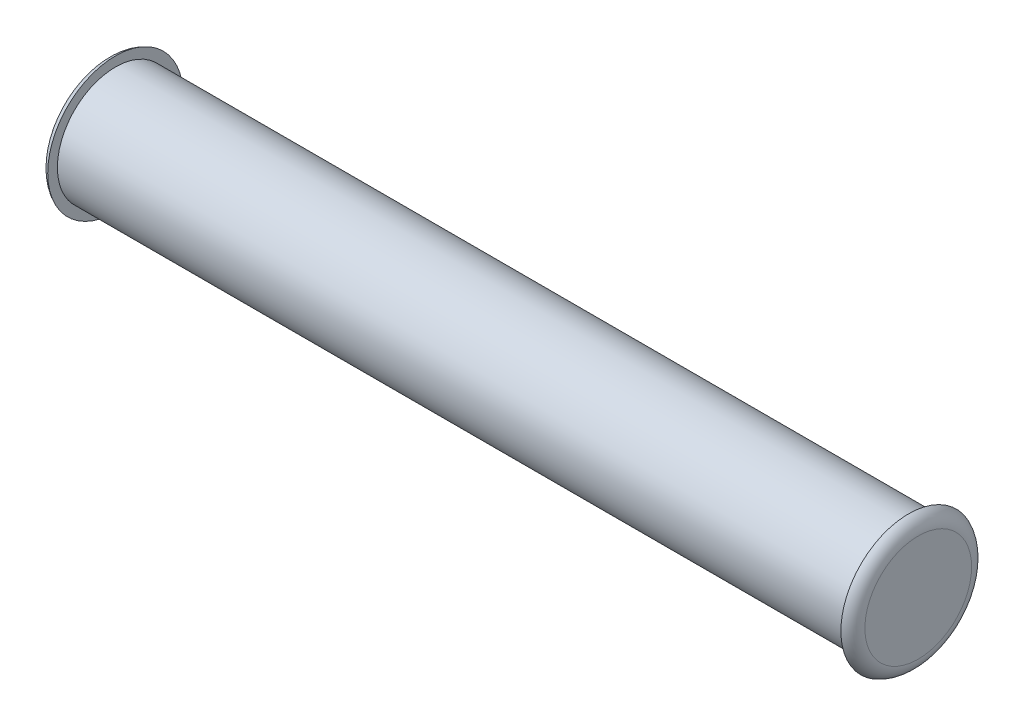
ISO-10303-21;
HEADER;
FILE_DESCRIPTION(('STEP AP214'),'2;1');
FILE_NAME('part.step','',(''),(''),'','','');
FILE_SCHEMA(('AUTOMOTIVE_DESIGN { 1 0 10303 214 1 1 1 1 }'));
ENDSEC;
DATA;
#1=APPLICATION_CONTEXT('core data for automotive mechanical design processes');
#2=APPLICATION_PROTOCOL_DEFINITION('international standard','automotive_design',2000,#1);
#3=PRODUCT_CONTEXT('',#1,'mechanical');
#4=PRODUCT('Part','Part','',(#3));
#5=PRODUCT_RELATED_PRODUCT_CATEGORY('part','',(#4));
#6=PRODUCT_DEFINITION_FORMATION('','',#4);
#7=PRODUCT_DEFINITION_CONTEXT('part definition',#1,'design');
#8=PRODUCT_DEFINITION('design','',#6,#7);
#9=PRODUCT_DEFINITION_SHAPE('','',#8);
#10=(LENGTH_UNIT() NAMED_UNIT(*) SI_UNIT(.MILLI.,.METRE.));
#11=(NAMED_UNIT(*) PLANE_ANGLE_UNIT() SI_UNIT($,.RADIAN.));
#12=(NAMED_UNIT(*) SI_UNIT($,.STERADIAN.) SOLID_ANGLE_UNIT());
#13=UNCERTAINTY_MEASURE_WITH_UNIT(LENGTH_MEASURE(1.E-05),#10,'distance_accuracy_value','');
#14=(GEOMETRIC_REPRESENTATION_CONTEXT(3) GLOBAL_UNCERTAINTY_ASSIGNED_CONTEXT((#13)) GLOBAL_UNIT_ASSIGNED_CONTEXT((#10,
#11,#12)) REPRESENTATION_CONTEXT('',''));
#15=CARTESIAN_POINT('',(0.,0.,0.));
#16=DIRECTION('',(0.,0.,1.));
#17=DIRECTION('',(1.,0.,0.));
#18=AXIS2_PLACEMENT_3D('',#15,#16,#17);
#19=CARTESIAN_POINT('',(10.414,0.,0.));
#20=DIRECTION('',(-1.,0.,0.));
#21=DIRECTION('',(0.,0.,1.));
#22=AXIS2_PLACEMENT_3D('',#19,#20,#21);
#23=CYLINDRICAL_SURFACE('',#22,0.762);
#24=CARTESIAN_POINT('',(10.414,0.,0.));
#25=DIRECTION('',(1.,0.,0.));
#26=DIRECTION('',(0.,0.,-1.));
#27=AXIS2_PLACEMENT_3D('',#24,#25,#26);
#28=CIRCLE('',#27,0.762);
#29=CARTESIAN_POINT('',(10.414,0.,-0.762));
#30=VERTEX_POINT('',#29);
#31=EDGE_CURVE('E43',#30,#30,#28,.T.);
#32=ORIENTED_EDGE('',*,*,#31,.F.);
#33=EDGE_LOOP('',(#32));
#34=FACE_BOUND('',#33,.T.);
#35=CARTESIAN_POINT('',(0.,0.,0.));
#36=DIRECTION('',(-1.,0.,0.));
#37=DIRECTION('',(0.,0.,1.));
#38=AXIS2_PLACEMENT_3D('',#35,#36,#37);
#39=CIRCLE('',#38,0.762);
#40=CARTESIAN_POINT('',(0.,0.,0.762));
#41=VERTEX_POINT('',#40);
#42=EDGE_CURVE('E52',#41,#41,#39,.T.);
#43=ORIENTED_EDGE('',*,*,#42,.F.);
#44=EDGE_LOOP('',(#43));
#45=FACE_BOUND('',#44,.T.);
#46=ADVANCED_FACE('F32',(#34,#45),#23,.T.);
#47=CARTESIAN_POINT('',(10.414,0.,0.));
#48=DIRECTION('',(1.,0.,0.));
#49=DIRECTION('',(0.,0.,-1.));
#50=AXIS2_PLACEMENT_3D('',#47,#48,#49);
#51=PLANE('',#50);
#52=CARTESIAN_POINT('',(10.414,0.,0.));
#53=DIRECTION('',(1.,0.,0.));
#54=DIRECTION('',(0.,0.,-1.));
#55=AXIS2_PLACEMENT_3D('',#52,#53,#54);
#56=CIRCLE('',#55,0.889);
#57=CARTESIAN_POINT('',(10.414,0.,-0.889));
#58=VERTEX_POINT('',#57);
#59=EDGE_CURVE('E47',#58,#58,#56,.T.);
#60=ORIENTED_EDGE('',*,*,#59,.F.);
#61=EDGE_LOOP('',(#60));
#62=FACE_BOUND('',#61,.T.);
#63=ORIENTED_EDGE('',*,*,#31,.T.);
#64=EDGE_LOOP('',(#63));
#65=FACE_BOUND('',#64,.T.);
#66=ADVANCED_FACE('F70',(#62,#65),#51,.F.);
#67=CARTESIAN_POINT('',(10.541,0.,0.));
#68=DIRECTION('',(1.,0.,0.));
#69=DIRECTION('',(0.,0.,-1.));
#70=AXIS2_PLACEMENT_3D('',#67,#68,#69);
#71=PLANE('',#70);
#72=CARTESIAN_POINT('',(10.541,0.,0.));
#73=DIRECTION('',(1.,0.,0.));
#74=DIRECTION('',(0.,0.,-1.));
#75=AXIS2_PLACEMENT_3D('',#72,#73,#74);
#76=CIRCLE('',#75,0.70062855842777);
#77=CARTESIAN_POINT('',(10.541,0.,-0.70062855842777));
#78=VERTEX_POINT('',#77);
#79=EDGE_CURVE('E39',#78,#78,#76,.T.);
#80=ORIENTED_EDGE('',*,*,#79,.T.);
#81=EDGE_LOOP('',(#80));
#82=FACE_BOUND('',#81,.T.);
#83=ADVANCED_FACE('F65',(#82),#71,.T.);
#84=CARTESIAN_POINT('',(0.,0.,0.));
#85=DIRECTION('',(-1.,0.,0.));
#86=DIRECTION('',(0.,0.,1.));
#87=AXIS2_PLACEMENT_3D('',#84,#85,#86);
#88=PLANE('',#87);
#89=CARTESIAN_POINT('',(0.,0.,0.));
#90=DIRECTION('',(-1.,0.,0.));
#91=DIRECTION('',(0.,0.,1.));
#92=AXIS2_PLACEMENT_3D('',#89,#90,#91);
#93=CIRCLE('',#92,0.889);
#94=CARTESIAN_POINT('',(0.,0.,0.889));
#95=VERTEX_POINT('',#94);
#96=EDGE_CURVE('E55',#95,#95,#93,.T.);
#97=ORIENTED_EDGE('',*,*,#96,.F.);
#98=EDGE_LOOP('',(#97));
#99=FACE_BOUND('',#98,.T.);
#100=ORIENTED_EDGE('',*,*,#42,.T.);
#101=EDGE_LOOP('',(#100));
#102=FACE_BOUND('',#101,.T.);
#103=ADVANCED_FACE('F61',(#99,#102),#88,.F.);
#104=CARTESIAN_POINT('',(-0.127,0.,0.));
#105=DIRECTION('',(-1.,0.,0.));
#106=DIRECTION('',(0.,0.,1.));
#107=AXIS2_PLACEMENT_3D('',#104,#105,#106);
#108=PLANE('',#107);
#109=CARTESIAN_POINT('',(-0.127,0.,0.));
#110=DIRECTION('',(-1.,0.,0.));
#111=DIRECTION('',(0.,0.,1.));
#112=AXIS2_PLACEMENT_3D('',#109,#110,#111);
#113=CIRCLE('',#112,0.70062855842777);
#114=CARTESIAN_POINT('',(-0.127,0.,0.70062855842777));
#115=VERTEX_POINT('',#114);
#116=EDGE_CURVE('E10',#115,#115,#113,.T.);
#117=ORIENTED_EDGE('',*,*,#116,.T.);
#118=EDGE_LOOP('',(#117));
#119=FACE_BOUND('',#118,.T.);
#120=ADVANCED_FACE('F64',(#119),#108,.T.);
#121=CARTESIAN_POINT('',(10.3378,0.,0.));
#122=DIRECTION('',(-1.,0.,0.));
#123=DIRECTION('',(0.,0.,1.));
#124=AXIS2_PLACEMENT_3D('',#121,#122,#123);
#125=TOROIDAL_SURFACE('',#124,0.70062855842777,0.2032);
#126=ORIENTED_EDGE('',*,*,#59,.T.);
#127=EDGE_LOOP('',(#126));
#128=FACE_BOUND('',#127,.T.);
#129=ORIENTED_EDGE('',*,*,#79,.F.);
#130=EDGE_LOOP('',(#129));
#131=FACE_BOUND('',#130,.T.);
#132=ADVANCED_FACE('F80',(#128,#131),#125,.T.);
#133=CARTESIAN_POINT('',(0.0762,0.,0.));
#134=DIRECTION('',(1.,0.,0.));
#135=DIRECTION('',(0.,0.,-1.));
#136=AXIS2_PLACEMENT_3D('',#133,#134,#135);
#137=TOROIDAL_SURFACE('',#136,0.70062855842777,0.2032);
#138=ORIENTED_EDGE('',*,*,#96,.T.);
#139=EDGE_LOOP('',(#138));
#140=FACE_BOUND('',#139,.T.);
#141=ORIENTED_EDGE('',*,*,#116,.F.);
#142=EDGE_LOOP('',(#141));
#143=FACE_BOUND('',#142,.T.);
#144=ADVANCED_FACE('F34',(#140,#143),#137,.T.);
#145=CLOSED_SHELL('',(#46,#66,#83,#103,#120,#132,#144));
#146=MANIFOLD_SOLID_BREP('B2',#145);
#147=ADVANCED_BREP_SHAPE_REPRESENTATION('',(#18,#146),#14);
#148=SHAPE_DEFINITION_REPRESENTATION(#9,#147);
ENDSEC;
END-ISO-10303-21;
